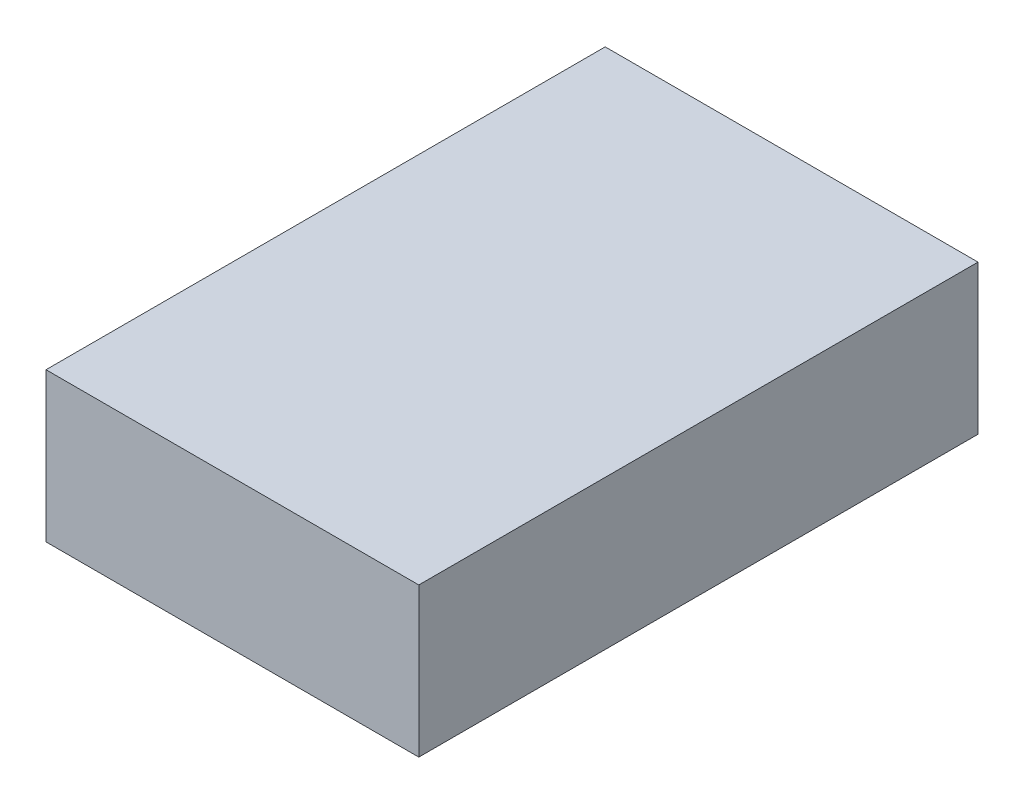
ISO-10303-21;
HEADER;
FILE_DESCRIPTION(('STEP AP214'),'2;1');
FILE_NAME('part.step','',(''),(''),'','','');
FILE_SCHEMA(('AUTOMOTIVE_DESIGN { 1 0 10303 214 1 1 1 1 }'));
ENDSEC;
DATA;
#1=APPLICATION_CONTEXT('core data for automotive mechanical design processes');
#2=APPLICATION_PROTOCOL_DEFINITION('international standard','automotive_design',2000,#1);
#3=PRODUCT_CONTEXT('',#1,'mechanical');
#4=PRODUCT('Part','Part','',(#3));
#5=PRODUCT_RELATED_PRODUCT_CATEGORY('part','',(#4));
#6=PRODUCT_DEFINITION_FORMATION('','',#4);
#7=PRODUCT_DEFINITION_CONTEXT('part definition',#1,'design');
#8=PRODUCT_DEFINITION('design','',#6,#7);
#9=PRODUCT_DEFINITION_SHAPE('','',#8);
#10=(LENGTH_UNIT() NAMED_UNIT(*) SI_UNIT(.MILLI.,.METRE.));
#11=(NAMED_UNIT(*) PLANE_ANGLE_UNIT() SI_UNIT($,.RADIAN.));
#12=(NAMED_UNIT(*) SI_UNIT($,.STERADIAN.) SOLID_ANGLE_UNIT());
#13=UNCERTAINTY_MEASURE_WITH_UNIT(LENGTH_MEASURE(1.E-05),#10,'distance_accuracy_value','');
#14=(GEOMETRIC_REPRESENTATION_CONTEXT(3) GLOBAL_UNCERTAINTY_ASSIGNED_CONTEXT((#13)) GLOBAL_UNIT_ASSIGNED_CONTEXT((#10,
#11,#12)) REPRESENTATION_CONTEXT('',''));
#15=CARTESIAN_POINT('',(0.,0.,0.));
#16=DIRECTION('',(0.,0.,1.));
#17=DIRECTION('',(1.,0.,0.));
#18=AXIS2_PLACEMENT_3D('',#15,#16,#17);
#19=CARTESIAN_POINT('',(1.,0.8,-1.5));
#20=DIRECTION('',(-1.,0.,0.));
#21=DIRECTION('',(0.,0.,1.));
#22=AXIS2_PLACEMENT_3D('',#19,#20,#21);
#23=PLANE('',#22);
#24=DIRECTION('',(0.,0.,-1.));
#25=VECTOR('',#24,1.);
#26=CARTESIAN_POINT('',(1.,0.,-1.5));
#27=LINE('',#26,#25);
#28=CARTESIAN_POINT('',(1.,0.,1.5));
#29=VERTEX_POINT('',#28);
#30=CARTESIAN_POINT('',(1.,0.,-1.5));
#31=VERTEX_POINT('',#30);
#32=EDGE_CURVE('E99',#29,#31,#27,.T.);
#33=ORIENTED_EDGE('',*,*,#32,.T.);
#34=DIRECTION('',(0.,-1.,0.));
#35=VECTOR('',#34,1.);
#36=CARTESIAN_POINT('',(1.,0.8,-1.5));
#37=LINE('',#36,#35);
#38=CARTESIAN_POINT('',(1.,0.8,-1.5));
#39=VERTEX_POINT('',#38);
#40=EDGE_CURVE('E11',#39,#31,#37,.T.);
#41=ORIENTED_EDGE('',*,*,#40,.F.);
#42=DIRECTION('',(0.,0.,-1.));
#43=VECTOR('',#42,1.);
#44=CARTESIAN_POINT('',(1.,0.8,-1.5));
#45=LINE('',#44,#43);
#46=CARTESIAN_POINT('',(1.,0.8,1.5));
#47=VERTEX_POINT('',#46);
#48=EDGE_CURVE('E87',#47,#39,#45,.T.);
#49=ORIENTED_EDGE('',*,*,#48,.F.);
#50=DIRECTION('',(0.,-1.,0.));
#51=VECTOR('',#50,1.);
#52=CARTESIAN_POINT('',(1.,0.8,1.5));
#53=LINE('',#52,#51);
#54=EDGE_CURVE('E95',#47,#29,#53,.T.);
#55=ORIENTED_EDGE('',*,*,#54,.T.);
#56=EDGE_LOOP('',(#33,#41,#49,#55));
#57=FACE_BOUND('',#56,.T.);
#58=ADVANCED_FACE('F36',(#57),#23,.F.);
#59=CARTESIAN_POINT('',(-1.,0.8,-1.5));
#60=DIRECTION('',(0.,0.,1.));
#61=DIRECTION('',(1.,0.,0.));
#62=AXIS2_PLACEMENT_3D('',#59,#60,#61);
#63=PLANE('',#62);
#64=DIRECTION('',(-1.,0.,0.));
#65=VECTOR('',#64,1.);
#66=CARTESIAN_POINT('',(-1.,0.,-1.5));
#67=LINE('',#66,#65);
#68=CARTESIAN_POINT('',(-1.,0.,-1.5));
#69=VERTEX_POINT('',#68);
#70=EDGE_CURVE('E91',#31,#69,#67,.T.);
#71=ORIENTED_EDGE('',*,*,#70,.T.);
#72=DIRECTION('',(0.,-1.,0.));
#73=VECTOR('',#72,1.);
#74=CARTESIAN_POINT('',(-1.,0.8,-1.5));
#75=LINE('',#74,#73);
#76=CARTESIAN_POINT('',(-1.,0.8,-1.5));
#77=VERTEX_POINT('',#76);
#78=EDGE_CURVE('E44',#77,#69,#75,.T.);
#79=ORIENTED_EDGE('',*,*,#78,.F.);
#80=DIRECTION('',(-1.,0.,0.));
#81=VECTOR('',#80,1.);
#82=CARTESIAN_POINT('',(-1.,0.8,-1.5));
#83=LINE('',#82,#81);
#84=EDGE_CURVE('E82',#39,#77,#83,.T.);
#85=ORIENTED_EDGE('',*,*,#84,.F.);
#86=ORIENTED_EDGE('',*,*,#40,.T.);
#87=EDGE_LOOP('',(#71,#79,#85,#86));
#88=FACE_BOUND('',#87,.T.);
#89=ADVANCED_FACE('F90',(#88),#63,.F.);
#90=CARTESIAN_POINT('',(-1.,0.8,-1.5));
#91=DIRECTION('',(1.,0.,0.));
#92=DIRECTION('',(0.,0.,-1.));
#93=AXIS2_PLACEMENT_3D('',#90,#91,#92);
#94=PLANE('',#93);
#95=DIRECTION('',(0.,0.,1.));
#96=VECTOR('',#95,1.);
#97=CARTESIAN_POINT('',(-1.,0.,-1.5));
#98=LINE('',#97,#96);
#99=CARTESIAN_POINT('',(-0.999999999999999,0.,1.5));
#100=VERTEX_POINT('',#99);
#101=EDGE_CURVE('E69',#69,#100,#98,.T.);
#102=ORIENTED_EDGE('',*,*,#101,.T.);
#103=DIRECTION('',(0.,-1.,0.));
#104=VECTOR('',#103,1.);
#105=CARTESIAN_POINT('',(-0.999999999999999,0.8,1.5));
#106=LINE('',#105,#104);
#107=CARTESIAN_POINT('',(-0.999999999999999,0.8,1.5));
#108=VERTEX_POINT('',#107);
#109=EDGE_CURVE('E92',#108,#100,#106,.T.);
#110=ORIENTED_EDGE('',*,*,#109,.F.);
#111=DIRECTION('',(0.,0.,1.));
#112=VECTOR('',#111,1.);
#113=CARTESIAN_POINT('',(-1.,0.8,-1.5));
#114=LINE('',#113,#112);
#115=EDGE_CURVE('E85',#77,#108,#114,.T.);
#116=ORIENTED_EDGE('',*,*,#115,.F.);
#117=ORIENTED_EDGE('',*,*,#78,.T.);
#118=EDGE_LOOP('',(#102,#110,#116,#117));
#119=FACE_BOUND('',#118,.T.);
#120=ADVANCED_FACE('F93',(#119),#94,.F.);
#121=CARTESIAN_POINT('',(-0.999999999999999,0.8,1.5));
#122=DIRECTION('',(0.,0.,-1.));
#123=DIRECTION('',(-1.,0.,0.));
#124=AXIS2_PLACEMENT_3D('',#121,#122,#123);
#125=PLANE('',#124);
#126=DIRECTION('',(1.,0.,0.));
#127=VECTOR('',#126,1.);
#128=CARTESIAN_POINT('',(-0.999999999999999,0.,1.5));
#129=LINE('',#128,#127);
#130=EDGE_CURVE('E75',#100,#29,#129,.T.);
#131=ORIENTED_EDGE('',*,*,#130,.T.);
#132=ORIENTED_EDGE('',*,*,#54,.F.);
#133=DIRECTION('',(1.,0.,0.));
#134=VECTOR('',#133,1.);
#135=CARTESIAN_POINT('',(-0.999999999999999,0.8,1.5));
#136=LINE('',#135,#134);
#137=EDGE_CURVE('E52',#108,#47,#136,.T.);
#138=ORIENTED_EDGE('',*,*,#137,.F.);
#139=ORIENTED_EDGE('',*,*,#109,.T.);
#140=EDGE_LOOP('',(#131,#132,#138,#139));
#141=FACE_BOUND('',#140,.T.);
#142=ADVANCED_FACE('F106',(#141),#125,.F.);
#143=CARTESIAN_POINT('',(0.,0.8,0.));
#144=DIRECTION('',(0.,1.,0.));
#145=DIRECTION('',(0.,0.,1.));
#146=AXIS2_PLACEMENT_3D('',#143,#144,#145);
#147=PLANE('',#146);
#148=ORIENTED_EDGE('',*,*,#48,.T.);
#149=ORIENTED_EDGE('',*,*,#84,.T.);
#150=ORIENTED_EDGE('',*,*,#115,.T.);
#151=ORIENTED_EDGE('',*,*,#137,.T.);
#152=EDGE_LOOP('',(#148,#149,#150,#151));
#153=FACE_BOUND('',#152,.T.);
#154=ADVANCED_FACE('F83',(#153),#147,.T.);
#155=CARTESIAN_POINT('',(0.,0.,0.));
#156=DIRECTION('',(0.,1.,0.));
#157=DIRECTION('',(0.,0.,1.));
#158=AXIS2_PLACEMENT_3D('',#155,#156,#157);
#159=PLANE('',#158);
#160=ORIENTED_EDGE('',*,*,#32,.F.);
#161=ORIENTED_EDGE('',*,*,#130,.F.);
#162=ORIENTED_EDGE('',*,*,#101,.F.);
#163=ORIENTED_EDGE('',*,*,#70,.F.);
#164=EDGE_LOOP('',(#160,#161,#162,#163));
#165=FACE_BOUND('',#164,.T.);
#166=ADVANCED_FACE('F109',(#165),#159,.F.);
#167=CLOSED_SHELL('',(#58,#89,#120,#142,#154,#166));
#168=MANIFOLD_SOLID_BREP('B2',#167);
#169=ADVANCED_BREP_SHAPE_REPRESENTATION('',(#18,#168),#14);
#170=SHAPE_DEFINITION_REPRESENTATION(#9,#169);
ENDSEC;
END-ISO-10303-21;
